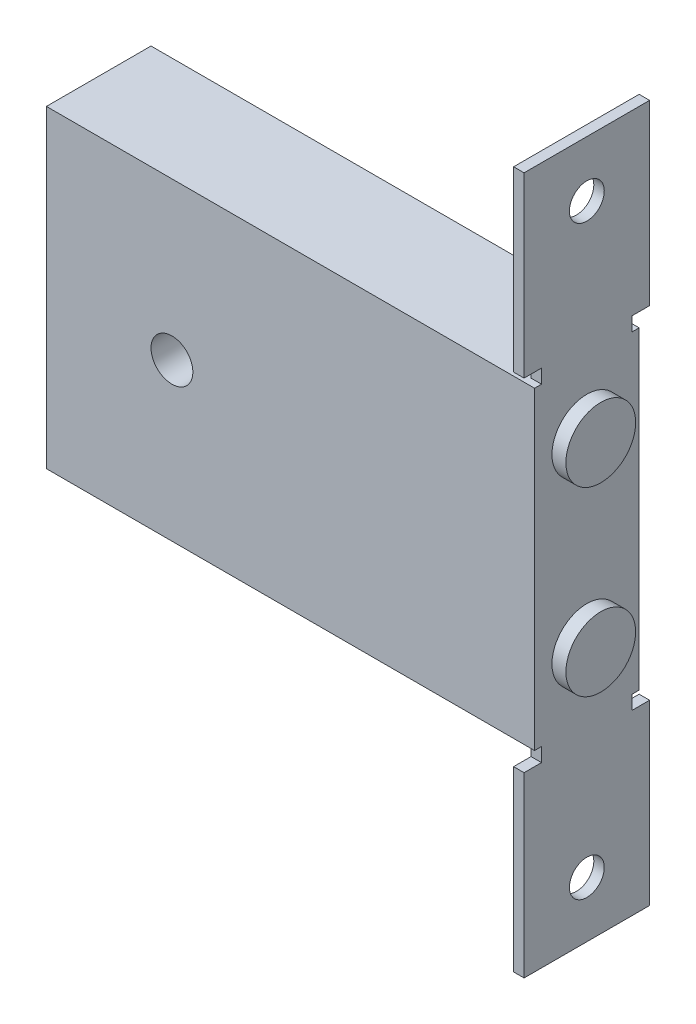
ISO-10303-21;
HEADER;
FILE_DESCRIPTION(('STEP AP214'),'2;1');
FILE_NAME('part.step','',(''),(''),'','','');
FILE_SCHEMA(('AUTOMOTIVE_DESIGN { 1 0 10303 214 1 1 1 1 }'));
ENDSEC;
DATA;
#1=APPLICATION_CONTEXT('core data for automotive mechanical design processes');
#2=APPLICATION_PROTOCOL_DEFINITION('international standard','automotive_design',2000,#1);
#3=PRODUCT_CONTEXT('',#1,'mechanical');
#4=PRODUCT('Part','Part','',(#3));
#5=PRODUCT_RELATED_PRODUCT_CATEGORY('part','',(#4));
#6=PRODUCT_DEFINITION_FORMATION('','',#4);
#7=PRODUCT_DEFINITION_CONTEXT('part definition',#1,'design');
#8=PRODUCT_DEFINITION('design','',#6,#7);
#9=PRODUCT_DEFINITION_SHAPE('','',#8);
#10=(LENGTH_UNIT() NAMED_UNIT(*) SI_UNIT(.MILLI.,.METRE.));
#11=(NAMED_UNIT(*) PLANE_ANGLE_UNIT() SI_UNIT($,.RADIAN.));
#12=(NAMED_UNIT(*) SI_UNIT($,.STERADIAN.) SOLID_ANGLE_UNIT());
#13=UNCERTAINTY_MEASURE_WITH_UNIT(LENGTH_MEASURE(1.E-05),#10,'distance_accuracy_value','');
#14=(GEOMETRIC_REPRESENTATION_CONTEXT(3) GLOBAL_UNCERTAINTY_ASSIGNED_CONTEXT((#13)) GLOBAL_UNIT_ASSIGNED_CONTEXT((#10,
#11,#12)) REPRESENTATION_CONTEXT('',''));
#15=CARTESIAN_POINT('',(0.,0.,0.));
#16=DIRECTION('',(0.,0.,1.));
#17=DIRECTION('',(1.,0.,0.));
#18=AXIS2_PLACEMENT_3D('',#15,#16,#17);
#19=CARTESIAN_POINT('',(0.,0.,15.));
#20=DIRECTION('',(0.,0.,-1.));
#21=DIRECTION('',(-1.,0.,0.));
#22=AXIS2_PLACEMENT_3D('',#19,#20,#21);
#23=PLANE('',#22);
#24=DIRECTION('',(0.,-1.,0.));
#25=VECTOR('',#24,1.);
#26=CARTESIAN_POINT('',(0.,0.,15.));
#27=LINE('',#26,#25);
#28=CARTESIAN_POINT('',(0.,45.,15.));
#29=VERTEX_POINT('',#28);
#30=CARTESIAN_POINT('',(0.,0.,15.));
#31=VERTEX_POINT('',#30);
#32=EDGE_CURVE('E308',#29,#31,#27,.T.);
#33=ORIENTED_EDGE('',*,*,#32,.T.);
#34=DIRECTION('',(1.,0.,0.));
#35=VECTOR('',#34,1.);
#36=CARTESIAN_POINT('',(0.,0.,15.));
#37=LINE('',#36,#35);
#38=CARTESIAN_POINT('',(70.,0.,15.));
#39=VERTEX_POINT('',#38);
#40=EDGE_CURVE('E311',#31,#39,#37,.T.);
#41=ORIENTED_EDGE('',*,*,#40,.T.);
#42=DIRECTION('',(0.,1.,0.));
#43=VECTOR('',#42,1.);
#44=CARTESIAN_POINT('',(70.,0.,15.));
#45=LINE('',#44,#43);
#46=CARTESIAN_POINT('',(70.,45.,15.));
#47=VERTEX_POINT('',#46);
#48=EDGE_CURVE('E314',#39,#47,#45,.T.);
#49=ORIENTED_EDGE('',*,*,#48,.T.);
#50=DIRECTION('',(-1.,0.,0.));
#51=VECTOR('',#50,1.);
#52=CARTESIAN_POINT('',(0.,45.,15.));
#53=LINE('',#52,#51);
#54=EDGE_CURVE('E316',#47,#29,#53,.T.);
#55=ORIENTED_EDGE('',*,*,#54,.T.);
#56=EDGE_LOOP('',(#33,#41,#49,#55));
#57=FACE_BOUND('',#56,.T.);
#58=CARTESIAN_POINT('',(18.,22.5,15.));
#59=DIRECTION('',(0.,0.,1.));
#60=DIRECTION('',(1.,0.,0.));
#61=AXIS2_PLACEMENT_3D('',#58,#59,#60);
#62=CIRCLE('',#61,3.);
#63=CARTESIAN_POINT('',(21.,22.5,15.));
#64=VERTEX_POINT('',#63);
#65=EDGE_CURVE('E302',#64,#64,#62,.T.);
#66=ORIENTED_EDGE('',*,*,#65,.F.);
#67=EDGE_LOOP('',(#66));
#68=FACE_BOUND('',#67,.T.);
#69=ADVANCED_FACE('F34',(#57,#68),#23,.F.);
#70=CARTESIAN_POINT('',(0.,0.,0.));
#71=DIRECTION('',(0.,0.,-1.));
#72=DIRECTION('',(-1.,0.,0.));
#73=AXIS2_PLACEMENT_3D('',#70,#71,#72);
#74=PLANE('',#73);
#75=DIRECTION('',(0.,-1.,0.));
#76=VECTOR('',#75,1.);
#77=CARTESIAN_POINT('',(0.,0.,0.));
#78=LINE('',#77,#76);
#79=CARTESIAN_POINT('',(0.,45.,0.));
#80=VERTEX_POINT('',#79);
#81=CARTESIAN_POINT('',(0.,0.,0.));
#82=VERTEX_POINT('',#81);
#83=EDGE_CURVE('E305',#80,#82,#78,.T.);
#84=ORIENTED_EDGE('',*,*,#83,.F.);
#85=DIRECTION('',(-1.,0.,0.));
#86=VECTOR('',#85,1.);
#87=CARTESIAN_POINT('',(0.,45.,0.));
#88=LINE('',#87,#86);
#89=CARTESIAN_POINT('',(70.,45.,0.));
#90=VERTEX_POINT('',#89);
#91=EDGE_CURVE('E312',#90,#80,#88,.T.);
#92=ORIENTED_EDGE('',*,*,#91,.F.);
#93=DIRECTION('',(0.,1.,0.));
#94=VECTOR('',#93,1.);
#95=CARTESIAN_POINT('',(70.,0.,0.));
#96=LINE('',#95,#94);
#97=CARTESIAN_POINT('',(70.,0.,0.));
#98=VERTEX_POINT('',#97);
#99=EDGE_CURVE('E324',#98,#90,#96,.T.);
#100=ORIENTED_EDGE('',*,*,#99,.F.);
#101=DIRECTION('',(1.,0.,0.));
#102=VECTOR('',#101,1.);
#103=CARTESIAN_POINT('',(0.,0.,0.));
#104=LINE('',#103,#102);
#105=EDGE_CURVE('E321',#82,#98,#104,.T.);
#106=ORIENTED_EDGE('',*,*,#105,.F.);
#107=EDGE_LOOP('',(#84,#92,#100,#106));
#108=FACE_BOUND('',#107,.T.);
#109=CARTESIAN_POINT('',(18.,22.5,0.));
#110=DIRECTION('',(0.,0.,1.));
#111=DIRECTION('',(1.,0.,0.));
#112=AXIS2_PLACEMENT_3D('',#109,#110,#111);
#113=CIRCLE('',#112,3.);
#114=CARTESIAN_POINT('',(21.,22.5,0.));
#115=VERTEX_POINT('',#114);
#116=EDGE_CURVE('E291',#115,#115,#113,.T.);
#117=ORIENTED_EDGE('',*,*,#116,.T.);
#118=EDGE_LOOP('',(#117));
#119=FACE_BOUND('',#118,.T.);
#120=ADVANCED_FACE('F392',(#108,#119),#74,.T.);
#121=CARTESIAN_POINT('',(0.,0.,15.));
#122=DIRECTION('',(1.,0.,0.));
#123=DIRECTION('',(0.,0.,-1.));
#124=AXIS2_PLACEMENT_3D('',#121,#122,#123);
#125=PLANE('',#124);
#126=ORIENTED_EDGE('',*,*,#83,.T.);
#127=DIRECTION('',(0.,0.,-1.));
#128=VECTOR('',#127,1.);
#129=CARTESIAN_POINT('',(0.,0.,15.));
#130=LINE('',#129,#128);
#131=EDGE_CURVE('E337',#31,#82,#130,.T.);
#132=ORIENTED_EDGE('',*,*,#131,.F.);
#133=ORIENTED_EDGE('',*,*,#32,.F.);
#134=DIRECTION('',(0.,0.,-1.));
#135=VECTOR('',#134,1.);
#136=CARTESIAN_POINT('',(0.,45.,15.));
#137=LINE('',#136,#135);
#138=EDGE_CURVE('E318',#29,#80,#137,.T.);
#139=ORIENTED_EDGE('',*,*,#138,.T.);
#140=EDGE_LOOP('',(#126,#132,#133,#139));
#141=FACE_BOUND('',#140,.T.);
#142=ADVANCED_FACE('F36',(#141),#125,.F.);
#143=CARTESIAN_POINT('',(0.,0.,15.));
#144=DIRECTION('',(0.,1.,0.));
#145=DIRECTION('',(0.,0.,1.));
#146=AXIS2_PLACEMENT_3D('',#143,#144,#145);
#147=PLANE('',#146);
#148=DIRECTION('',(0.,0.,-1.));
#149=VECTOR('',#148,1.);
#150=CARTESIAN_POINT('',(70.,0.,15.));
#151=LINE('',#150,#149);
#152=CARTESIAN_POINT('',(70.,0.,1.));
#153=VERTEX_POINT('',#152);
#154=EDGE_CURVE('E333',#153,#98,#151,.T.);
#155=ORIENTED_EDGE('',*,*,#154,.F.);
#156=DIRECTION('',(-1.,0.,0.));
#157=VECTOR('',#156,1.);
#158=CARTESIAN_POINT('',(0.,0.,1.));
#159=LINE('',#158,#157);
#160=CARTESIAN_POINT('',(68.5,0.,1.));
#161=VERTEX_POINT('',#160);
#162=EDGE_CURVE('E239',#153,#161,#159,.T.);
#163=ORIENTED_EDGE('',*,*,#162,.T.);
#164=DIRECTION('',(0.,0.,-1.));
#165=VECTOR('',#164,1.);
#166=CARTESIAN_POINT('',(68.5,0.,15.));
#167=LINE('',#166,#165);
#168=CARTESIAN_POINT('',(68.5,0.,14.));
#169=VERTEX_POINT('',#168);
#170=EDGE_CURVE('E345',#169,#161,#167,.T.);
#171=ORIENTED_EDGE('',*,*,#170,.F.);
#172=DIRECTION('',(1.,0.,0.));
#173=VECTOR('',#172,1.);
#174=CARTESIAN_POINT('',(0.,0.,14.));
#175=LINE('',#174,#173);
#176=CARTESIAN_POINT('',(70.,0.,14.));
#177=VERTEX_POINT('',#176);
#178=EDGE_CURVE('E179',#169,#177,#175,.T.);
#179=ORIENTED_EDGE('',*,*,#178,.T.);
#180=EDGE_CURVE('E334',#39,#177,#151,.T.);
#181=ORIENTED_EDGE('',*,*,#180,.F.);
#182=ORIENTED_EDGE('',*,*,#40,.F.);
#183=ORIENTED_EDGE('',*,*,#131,.T.);
#184=ORIENTED_EDGE('',*,*,#105,.T.);
#185=EDGE_LOOP('',(#155,#163,#171,#179,#181,#182,#183,#184));
#186=FACE_BOUND('',#185,.T.);
#187=ADVANCED_FACE('F354',(#186),#147,.F.);
#188=CARTESIAN_POINT('',(70.,0.,15.));
#189=DIRECTION('',(-1.,0.,0.));
#190=DIRECTION('',(0.,0.,1.));
#191=AXIS2_PLACEMENT_3D('',#188,#189,#190);
#192=PLANE('',#191);
#193=CARTESIAN_POINT('',(70.,9.5,7.5));
#194=DIRECTION('',(-1.,0.,0.));
#195=DIRECTION('',(0.,0.,1.));
#196=AXIS2_PLACEMENT_3D('',#193,#194,#195);
#197=CIRCLE('',#196,5.);
#198=CARTESIAN_POINT('',(70.,9.5,12.5));
#199=VERTEX_POINT('',#198);
#200=EDGE_CURVE('E11',#199,#199,#197,.F.);
#201=ORIENTED_EDGE('',*,*,#200,.F.);
#202=EDGE_LOOP('',(#201));
#203=FACE_BOUND('',#202,.T.);
#204=CARTESIAN_POINT('',(70.,35.5,7.5));
#205=DIRECTION('',(-1.,0.,0.));
#206=DIRECTION('',(0.,0.,1.));
#207=AXIS2_PLACEMENT_3D('',#204,#205,#206);
#208=CIRCLE('',#207,5.);
#209=CARTESIAN_POINT('',(70.,35.5,12.5));
#210=VERTEX_POINT('',#209);
#211=EDGE_CURVE('E42',#210,#210,#208,.F.);
#212=ORIENTED_EDGE('',*,*,#211,.F.);
#213=EDGE_LOOP('',(#212));
#214=FACE_BOUND('',#213,.T.);
#215=ORIENTED_EDGE('',*,*,#180,.T.);
#216=DIRECTION('',(0.,-1.,0.));
#217=VECTOR('',#216,1.);
#218=CARTESIAN_POINT('',(70.,2.04661702711344,14.));
#219=LINE('',#218,#217);
#220=CARTESIAN_POINT('',(70.,-2.00000000000002,14.));
#221=VERTEX_POINT('',#220);
#222=EDGE_CURVE('E213',#177,#221,#219,.T.);
#223=ORIENTED_EDGE('',*,*,#222,.T.);
#224=DIRECTION('',(0.,0.,1.));
#225=VECTOR('',#224,1.);
#226=CARTESIAN_POINT('',(70.,-2.00000000000002,14.));
#227=LINE('',#226,#225);
#228=CARTESIAN_POINT('',(70.,-2.00000000000002,16.5));
#229=VERTEX_POINT('',#228);
#230=EDGE_CURVE('E189',#221,#229,#227,.T.);
#231=ORIENTED_EDGE('',*,*,#230,.T.);
#232=DIRECTION('',(0.,-1.,0.));
#233=VECTOR('',#232,1.);
#234=CARTESIAN_POINT('',(70.,-2.00000000000002,16.5));
#235=LINE('',#234,#233);
#236=CARTESIAN_POINT('',(70.,-27.5,16.5));
#237=VERTEX_POINT('',#236);
#238=EDGE_CURVE('E217',#229,#237,#235,.T.);
#239=ORIENTED_EDGE('',*,*,#238,.T.);
#240=DIRECTION('',(0.,0.,-1.));
#241=VECTOR('',#240,1.);
#242=CARTESIAN_POINT('',(70.,-27.5,-1.5));
#243=LINE('',#242,#241);
#244=CARTESIAN_POINT('',(70.,-27.5,-1.5));
#245=VERTEX_POINT('',#244);
#246=EDGE_CURVE('E220',#237,#245,#243,.T.);
#247=ORIENTED_EDGE('',*,*,#246,.T.);
#248=DIRECTION('',(0.,1.,0.));
#249=VECTOR('',#248,1.);
#250=CARTESIAN_POINT('',(70.,-2.00000000000002,-1.5));
#251=LINE('',#250,#249);
#252=CARTESIAN_POINT('',(70.,-2.00000000000002,-1.5));
#253=VERTEX_POINT('',#252);
#254=EDGE_CURVE('E223',#245,#253,#251,.T.);
#255=ORIENTED_EDGE('',*,*,#254,.T.);
#256=DIRECTION('',(0.,0.,1.));
#257=VECTOR('',#256,1.);
#258=CARTESIAN_POINT('',(70.,-2.00000000000002,1.));
#259=LINE('',#258,#257);
#260=CARTESIAN_POINT('',(70.,-2.00000000000002,1.));
#261=VERTEX_POINT('',#260);
#262=EDGE_CURVE('E226',#253,#261,#259,.T.);
#263=ORIENTED_EDGE('',*,*,#262,.T.);
#264=DIRECTION('',(0.,1.,0.));
#265=VECTOR('',#264,1.);
#266=CARTESIAN_POINT('',(70.,2.04661702711344,1.));
#267=LINE('',#266,#265);
#268=EDGE_CURVE('E49',#261,#153,#267,.T.);
#269=ORIENTED_EDGE('',*,*,#268,.T.);
#270=ORIENTED_EDGE('',*,*,#154,.T.);
#271=ORIENTED_EDGE('',*,*,#99,.T.);
#272=DIRECTION('',(0.,0.,-1.));
#273=VECTOR('',#272,1.);
#274=CARTESIAN_POINT('',(70.,45.,15.));
#275=LINE('',#274,#273);
#276=CARTESIAN_POINT('',(70.,45.,1.));
#277=VERTEX_POINT('',#276);
#278=EDGE_CURVE('E330',#277,#90,#275,.T.);
#279=ORIENTED_EDGE('',*,*,#278,.F.);
#280=DIRECTION('',(0.,1.,0.));
#281=VECTOR('',#280,1.);
#282=CARTESIAN_POINT('',(70.,42.9533829728865,1.));
#283=LINE('',#282,#281);
#284=CARTESIAN_POINT('',(70.,47.,1.));
#285=VERTEX_POINT('',#284);
#286=EDGE_CURVE('E246',#277,#285,#283,.T.);
#287=ORIENTED_EDGE('',*,*,#286,.T.);
#288=DIRECTION('',(0.,0.,-1.));
#289=VECTOR('',#288,1.);
#290=CARTESIAN_POINT('',(70.,47.,1.));
#291=LINE('',#290,#289);
#292=CARTESIAN_POINT('',(70.,47.,-1.5));
#293=VERTEX_POINT('',#292);
#294=EDGE_CURVE('E272',#285,#293,#291,.T.);
#295=ORIENTED_EDGE('',*,*,#294,.T.);
#296=DIRECTION('',(0.,1.,0.));
#297=VECTOR('',#296,1.);
#298=CARTESIAN_POINT('',(70.,47.,-1.5));
#299=LINE('',#298,#297);
#300=CARTESIAN_POINT('',(70.,72.5,-1.5));
#301=VERTEX_POINT('',#300);
#302=EDGE_CURVE('E275',#293,#301,#299,.T.);
#303=ORIENTED_EDGE('',*,*,#302,.T.);
#304=DIRECTION('',(0.,0.,1.));
#305=VECTOR('',#304,1.);
#306=CARTESIAN_POINT('',(70.,72.5,-1.5));
#307=LINE('',#306,#305);
#308=CARTESIAN_POINT('',(70.,72.5,16.5));
#309=VERTEX_POINT('',#308);
#310=EDGE_CURVE('E278',#301,#309,#307,.T.);
#311=ORIENTED_EDGE('',*,*,#310,.T.);
#312=DIRECTION('',(0.,-1.,0.));
#313=VECTOR('',#312,1.);
#314=CARTESIAN_POINT('',(70.,47.,16.5));
#315=LINE('',#314,#313);
#316=CARTESIAN_POINT('',(70.,47.,16.5));
#317=VERTEX_POINT('',#316);
#318=EDGE_CURVE('E281',#309,#317,#315,.T.);
#319=ORIENTED_EDGE('',*,*,#318,.T.);
#320=DIRECTION('',(0.,0.,-1.));
#321=VECTOR('',#320,1.);
#322=CARTESIAN_POINT('',(70.,47.,14.));
#323=LINE('',#322,#321);
#324=CARTESIAN_POINT('',(70.,47.,14.));
#325=VERTEX_POINT('',#324);
#326=EDGE_CURVE('E284',#317,#325,#323,.T.);
#327=ORIENTED_EDGE('',*,*,#326,.T.);
#328=DIRECTION('',(0.,-1.,0.));
#329=VECTOR('',#328,1.);
#330=CARTESIAN_POINT('',(70.,42.9533829728865,14.));
#331=LINE('',#330,#329);
#332=CARTESIAN_POINT('',(70.,45.,14.));
#333=VERTEX_POINT('',#332);
#334=EDGE_CURVE('E252',#325,#333,#331,.T.);
#335=ORIENTED_EDGE('',*,*,#334,.T.);
#336=EDGE_CURVE('E331',#47,#333,#275,.T.);
#337=ORIENTED_EDGE('',*,*,#336,.F.);
#338=ORIENTED_EDGE('',*,*,#48,.F.);
#339=EDGE_LOOP('',(#215,#223,#231,#239,#247,#255,#263,#269,#270,#271,#279,#287,#295,#303,#311,
#319,#327,#335,#337,#338));
#340=FACE_BOUND('',#339,.T.);
#341=CARTESIAN_POINT('',(70.,64.5,7.5));
#342=DIRECTION('',(1.,0.,0.));
#343=DIRECTION('',(0.,0.,-1.));
#344=AXIS2_PLACEMENT_3D('',#341,#342,#343);
#345=CIRCLE('',#344,2.5);
#346=CARTESIAN_POINT('',(70.,64.5,5.));
#347=VERTEX_POINT('',#346);
#348=EDGE_CURVE('E242',#347,#347,#345,.T.);
#349=ORIENTED_EDGE('',*,*,#348,.F.);
#350=EDGE_LOOP('',(#349));
#351=FACE_BOUND('',#350,.T.);
#352=CARTESIAN_POINT('',(70.,-19.5,7.5));
#353=DIRECTION('',(1.,0.,0.));
#354=DIRECTION('',(0.,0.,1.));
#355=AXIS2_PLACEMENT_3D('',#352,#353,#354);
#356=CIRCLE('',#355,2.5);
#357=CARTESIAN_POINT('',(70.,-19.5,10.));
#358=VERTEX_POINT('',#357);
#359=EDGE_CURVE('E364',#358,#358,#356,.T.);
#360=ORIENTED_EDGE('',*,*,#359,.F.);
#361=EDGE_LOOP('',(#360));
#362=FACE_BOUND('',#361,.T.);
#363=ADVANCED_FACE('F351',(#203,#214,#340,#351,#362),#192,.F.);
#364=CARTESIAN_POINT('',(0.,45.,15.));
#365=DIRECTION('',(0.,-1.,0.));
#366=DIRECTION('',(0.,0.,-1.));
#367=AXIS2_PLACEMENT_3D('',#364,#365,#366);
#368=PLANE('',#367);
#369=ORIENTED_EDGE('',*,*,#336,.T.);
#370=DIRECTION('',(-1.,0.,0.));
#371=VECTOR('',#370,1.);
#372=CARTESIAN_POINT('',(0.,45.,14.));
#373=LINE('',#372,#371);
#374=CARTESIAN_POINT('',(68.5,45.,14.));
#375=VERTEX_POINT('',#374);
#376=EDGE_CURVE('E343',#333,#375,#373,.T.);
#377=ORIENTED_EDGE('',*,*,#376,.T.);
#378=DIRECTION('',(0.,0.,-1.));
#379=VECTOR('',#378,1.);
#380=CARTESIAN_POINT('',(68.5,45.,15.));
#381=LINE('',#380,#379);
#382=CARTESIAN_POINT('',(68.5,45.,1.));
#383=VERTEX_POINT('',#382);
#384=EDGE_CURVE('E57',#375,#383,#381,.T.);
#385=ORIENTED_EDGE('',*,*,#384,.T.);
#386=DIRECTION('',(1.,0.,0.));
#387=VECTOR('',#386,1.);
#388=CARTESIAN_POINT('',(0.,45.,1.));
#389=LINE('',#388,#387);
#390=EDGE_CURVE('E341',#383,#277,#389,.T.);
#391=ORIENTED_EDGE('',*,*,#390,.T.);
#392=ORIENTED_EDGE('',*,*,#278,.T.);
#393=ORIENTED_EDGE('',*,*,#91,.T.);
#394=ORIENTED_EDGE('',*,*,#138,.F.);
#395=ORIENTED_EDGE('',*,*,#54,.F.);
#396=EDGE_LOOP('',(#369,#377,#385,#391,#392,#393,#394,#395));
#397=FACE_BOUND('',#396,.T.);
#398=ADVANCED_FACE('F353',(#397),#368,.F.);
#399=CARTESIAN_POINT('',(18.,22.5,15.));
#400=DIRECTION('',(0.,0.,-1.));
#401=DIRECTION('',(-1.,0.,0.));
#402=AXIS2_PLACEMENT_3D('',#399,#400,#401);
#403=CYLINDRICAL_SURFACE('',#402,3.);
#404=ORIENTED_EDGE('',*,*,#65,.T.);
#405=EDGE_LOOP('',(#404));
#406=FACE_BOUND('',#405,.T.);
#407=ORIENTED_EDGE('',*,*,#116,.F.);
#408=EDGE_LOOP('',(#407));
#409=FACE_BOUND('',#408,.T.);
#410=ADVANCED_FACE('F402',(#406,#409),#403,.F.);
#411=CARTESIAN_POINT('',(68.5,42.9533829728865,14.));
#412=DIRECTION('',(0.,0.,1.));
#413=DIRECTION('',(1.,0.,0.));
#414=AXIS2_PLACEMENT_3D('',#411,#412,#413);
#415=PLANE('',#414);
#416=ORIENTED_EDGE('',*,*,#376,.F.);
#417=ORIENTED_EDGE('',*,*,#334,.F.);
#418=DIRECTION('',(1.,0.,0.));
#419=VECTOR('',#418,1.);
#420=CARTESIAN_POINT('',(68.5,47.,14.));
#421=LINE('',#420,#419);
#422=CARTESIAN_POINT('',(68.5,47.,14.));
#423=VERTEX_POINT('',#422);
#424=EDGE_CURVE('E289',#423,#325,#421,.T.);
#425=ORIENTED_EDGE('',*,*,#424,.F.);
#426=DIRECTION('',(0.,-1.,0.));
#427=VECTOR('',#426,1.);
#428=CARTESIAN_POINT('',(68.5,42.9533829728865,14.));
#429=LINE('',#428,#427);
#430=EDGE_CURVE('E267',#423,#375,#429,.T.);
#431=ORIENTED_EDGE('',*,*,#430,.T.);
#432=EDGE_LOOP('',(#416,#417,#425,#431));
#433=FACE_BOUND('',#432,.T.);
#434=ADVANCED_FACE('F425',(#433),#415,.T.);
#435=CARTESIAN_POINT('',(68.5,42.9533829728865,1.));
#436=DIRECTION('',(0.,0.,-1.));
#437=DIRECTION('',(-1.,0.,0.));
#438=AXIS2_PLACEMENT_3D('',#435,#436,#437);
#439=PLANE('',#438);
#440=ORIENTED_EDGE('',*,*,#390,.F.);
#441=DIRECTION('',(0.,1.,0.));
#442=VECTOR('',#441,1.);
#443=CARTESIAN_POINT('',(68.5,42.9533829728865,1.));
#444=LINE('',#443,#442);
#445=CARTESIAN_POINT('',(68.5,47.,1.));
#446=VERTEX_POINT('',#445);
#447=EDGE_CURVE('E249',#383,#446,#444,.T.);
#448=ORIENTED_EDGE('',*,*,#447,.T.);
#449=DIRECTION('',(1.,0.,0.));
#450=VECTOR('',#449,1.);
#451=CARTESIAN_POINT('',(68.5,47.,1.));
#452=LINE('',#451,#450);
#453=EDGE_CURVE('E270',#446,#285,#452,.T.);
#454=ORIENTED_EDGE('',*,*,#453,.T.);
#455=ORIENTED_EDGE('',*,*,#286,.F.);
#456=EDGE_LOOP('',(#440,#448,#454,#455));
#457=FACE_BOUND('',#456,.T.);
#458=ADVANCED_FACE('F440',(#457),#439,.T.);
#459=CARTESIAN_POINT('',(68.5,0.,0.));
#460=DIRECTION('',(-1.,0.,0.));
#461=DIRECTION('',(0.,0.,1.));
#462=AXIS2_PLACEMENT_3D('',#459,#460,#461);
#463=PLANE('',#462);
#464=CARTESIAN_POINT('',(68.5,64.5,7.5));
#465=DIRECTION('',(1.,0.,0.));
#466=DIRECTION('',(0.,0.,-1.));
#467=AXIS2_PLACEMENT_3D('',#464,#465,#466);
#468=CIRCLE('',#467,2.5);
#469=CARTESIAN_POINT('',(68.5,64.5,5.));
#470=VERTEX_POINT('',#469);
#471=EDGE_CURVE('E243',#470,#470,#468,.T.);
#472=ORIENTED_EDGE('',*,*,#471,.T.);
#473=EDGE_LOOP('',(#472));
#474=FACE_BOUND('',#473,.T.);
#475=ORIENTED_EDGE('',*,*,#384,.F.);
#476=ORIENTED_EDGE('',*,*,#430,.F.);
#477=DIRECTION('',(0.,0.,-1.));
#478=VECTOR('',#477,1.);
#479=CARTESIAN_POINT('',(68.5,47.,14.));
#480=LINE('',#479,#478);
#481=CARTESIAN_POINT('',(68.5,47.,16.5));
#482=VERTEX_POINT('',#481);
#483=EDGE_CURVE('E264',#482,#423,#480,.T.);
#484=ORIENTED_EDGE('',*,*,#483,.F.);
#485=DIRECTION('',(0.,-1.,0.));
#486=VECTOR('',#485,1.);
#487=CARTESIAN_POINT('',(68.5,47.,16.5));
#488=LINE('',#487,#486);
#489=CARTESIAN_POINT('',(68.5,72.5,16.5));
#490=VERTEX_POINT('',#489);
#491=EDGE_CURVE('E261',#490,#482,#488,.T.);
#492=ORIENTED_EDGE('',*,*,#491,.F.);
#493=DIRECTION('',(0.,0.,1.));
#494=VECTOR('',#493,1.);
#495=CARTESIAN_POINT('',(68.5,72.5,-1.5));
#496=LINE('',#495,#494);
#497=CARTESIAN_POINT('',(68.5,72.5,-1.5));
#498=VERTEX_POINT('',#497);
#499=EDGE_CURVE('E258',#498,#490,#496,.T.);
#500=ORIENTED_EDGE('',*,*,#499,.F.);
#501=DIRECTION('',(0.,1.,0.));
#502=VECTOR('',#501,1.);
#503=CARTESIAN_POINT('',(68.5,47.,-1.5));
#504=LINE('',#503,#502);
#505=CARTESIAN_POINT('',(68.5,47.,-1.5));
#506=VERTEX_POINT('',#505);
#507=EDGE_CURVE('E255',#506,#498,#504,.T.);
#508=ORIENTED_EDGE('',*,*,#507,.F.);
#509=DIRECTION('',(0.,0.,-1.));
#510=VECTOR('',#509,1.);
#511=CARTESIAN_POINT('',(68.5,47.,1.));
#512=LINE('',#511,#510);
#513=EDGE_CURVE('E251',#446,#506,#512,.T.);
#514=ORIENTED_EDGE('',*,*,#513,.F.);
#515=ORIENTED_EDGE('',*,*,#447,.F.);
#516=EDGE_LOOP('',(#475,#476,#484,#492,#500,#508,#514,#515));
#517=FACE_BOUND('',#516,.T.);
#518=ADVANCED_FACE('F434',(#474,#517),#463,.T.);
#519=CARTESIAN_POINT('',(68.5,47.,14.));
#520=DIRECTION('',(0.,-1.,0.));
#521=DIRECTION('',(0.,0.,-1.));
#522=AXIS2_PLACEMENT_3D('',#519,#520,#521);
#523=PLANE('',#522);
#524=ORIENTED_EDGE('',*,*,#326,.F.);
#525=DIRECTION('',(1.,0.,0.));
#526=VECTOR('',#525,1.);
#527=CARTESIAN_POINT('',(68.5,47.,16.5));
#528=LINE('',#527,#526);
#529=EDGE_CURVE('E292',#482,#317,#528,.T.);
#530=ORIENTED_EDGE('',*,*,#529,.F.);
#531=ORIENTED_EDGE('',*,*,#483,.T.);
#532=ORIENTED_EDGE('',*,*,#424,.T.);
#533=EDGE_LOOP('',(#524,#530,#531,#532));
#534=FACE_BOUND('',#533,.T.);
#535=ADVANCED_FACE('F430',(#534),#523,.T.);
#536=CARTESIAN_POINT('',(68.5,47.,16.5));
#537=DIRECTION('',(0.,0.,1.));
#538=DIRECTION('',(1.,0.,0.));
#539=AXIS2_PLACEMENT_3D('',#536,#537,#538);
#540=PLANE('',#539);
#541=ORIENTED_EDGE('',*,*,#318,.F.);
#542=DIRECTION('',(1.,0.,0.));
#543=VECTOR('',#542,1.);
#544=CARTESIAN_POINT('',(68.5,72.5,16.5));
#545=LINE('',#544,#543);
#546=EDGE_CURVE('E294',#490,#309,#545,.T.);
#547=ORIENTED_EDGE('',*,*,#546,.F.);
#548=ORIENTED_EDGE('',*,*,#491,.T.);
#549=ORIENTED_EDGE('',*,*,#529,.T.);
#550=EDGE_LOOP('',(#541,#547,#548,#549));
#551=FACE_BOUND('',#550,.T.);
#552=ADVANCED_FACE('F453',(#551),#540,.T.);
#553=CARTESIAN_POINT('',(68.5,72.5,-1.5));
#554=DIRECTION('',(0.,1.,0.));
#555=DIRECTION('',(0.,0.,1.));
#556=AXIS2_PLACEMENT_3D('',#553,#554,#555);
#557=PLANE('',#556);
#558=ORIENTED_EDGE('',*,*,#310,.F.);
#559=DIRECTION('',(1.,0.,0.));
#560=VECTOR('',#559,1.);
#561=CARTESIAN_POINT('',(68.5,72.5,-1.5));
#562=LINE('',#561,#560);
#563=EDGE_CURVE('E296',#498,#301,#562,.T.);
#564=ORIENTED_EDGE('',*,*,#563,.F.);
#565=ORIENTED_EDGE('',*,*,#499,.T.);
#566=ORIENTED_EDGE('',*,*,#546,.T.);
#567=EDGE_LOOP('',(#558,#564,#565,#566));
#568=FACE_BOUND('',#567,.T.);
#569=ADVANCED_FACE('F451',(#568),#557,.T.);
#570=CARTESIAN_POINT('',(68.5,47.,-1.5));
#571=DIRECTION('',(0.,0.,-1.));
#572=DIRECTION('',(-1.,0.,0.));
#573=AXIS2_PLACEMENT_3D('',#570,#571,#572);
#574=PLANE('',#573);
#575=ORIENTED_EDGE('',*,*,#302,.F.);
#576=DIRECTION('',(1.,0.,0.));
#577=VECTOR('',#576,1.);
#578=CARTESIAN_POINT('',(68.5,47.,-1.5));
#579=LINE('',#578,#577);
#580=EDGE_CURVE('E298',#506,#293,#579,.T.);
#581=ORIENTED_EDGE('',*,*,#580,.F.);
#582=ORIENTED_EDGE('',*,*,#507,.T.);
#583=ORIENTED_EDGE('',*,*,#563,.T.);
#584=EDGE_LOOP('',(#575,#581,#582,#583));
#585=FACE_BOUND('',#584,.T.);
#586=ADVANCED_FACE('F448',(#585),#574,.T.);
#587=CARTESIAN_POINT('',(68.5,47.,1.));
#588=DIRECTION('',(0.,-1.,0.));
#589=DIRECTION('',(0.,0.,-1.));
#590=AXIS2_PLACEMENT_3D('',#587,#588,#589);
#591=PLANE('',#590);
#592=ORIENTED_EDGE('',*,*,#294,.F.);
#593=ORIENTED_EDGE('',*,*,#453,.F.);
#594=ORIENTED_EDGE('',*,*,#513,.T.);
#595=ORIENTED_EDGE('',*,*,#580,.T.);
#596=EDGE_LOOP('',(#592,#593,#594,#595));
#597=FACE_BOUND('',#596,.T.);
#598=ADVANCED_FACE('F444',(#597),#591,.T.);
#599=CARTESIAN_POINT('',(68.5,64.5,7.5));
#600=DIRECTION('',(1.,0.,0.));
#601=DIRECTION('',(0.,0.,-1.));
#602=AXIS2_PLACEMENT_3D('',#599,#600,#601);
#603=CYLINDRICAL_SURFACE('',#602,2.5);
#604=ORIENTED_EDGE('',*,*,#471,.F.);
#605=EDGE_LOOP('',(#604));
#606=FACE_BOUND('',#605,.T.);
#607=ORIENTED_EDGE('',*,*,#348,.T.);
#608=EDGE_LOOP('',(#607));
#609=FACE_BOUND('',#608,.T.);
#610=ADVANCED_FACE('F467',(#606,#609),#603,.F.);
#611=CARTESIAN_POINT('',(68.5,0.,0.));
#612=DIRECTION('',(1.,0.,0.));
#613=DIRECTION('',(0.,0.,-1.));
#614=AXIS2_PLACEMENT_3D('',#611,#612,#613);
#615=PLANE('',#614);
#616=CARTESIAN_POINT('',(68.5,-19.5,7.5));
#617=DIRECTION('',(1.,0.,0.));
#618=DIRECTION('',(0.,0.,1.));
#619=AXIS2_PLACEMENT_3D('',#616,#617,#618);
#620=CIRCLE('',#619,2.5);
#621=CARTESIAN_POINT('',(68.5,-19.5,10.));
#622=VERTEX_POINT('',#621);
#623=EDGE_CURVE('E215',#622,#622,#620,.T.);
#624=ORIENTED_EDGE('',*,*,#623,.T.);
#625=EDGE_LOOP('',(#624));
#626=FACE_BOUND('',#625,.T.);
#627=DIRECTION('',(0.,-1.,0.));
#628=VECTOR('',#627,1.);
#629=CARTESIAN_POINT('',(68.5,2.04661702711344,14.));
#630=LINE('',#629,#628);
#631=CARTESIAN_POINT('',(68.5,-2.00000000000002,14.));
#632=VERTEX_POINT('',#631);
#633=EDGE_CURVE('E173',#169,#632,#630,.T.);
#634=ORIENTED_EDGE('',*,*,#633,.F.);
#635=ORIENTED_EDGE('',*,*,#170,.T.);
#636=DIRECTION('',(0.,1.,0.));
#637=VECTOR('',#636,1.);
#638=CARTESIAN_POINT('',(68.5,2.04661702711344,1.));
#639=LINE('',#638,#637);
#640=CARTESIAN_POINT('',(68.5,-2.00000000000002,1.));
#641=VERTEX_POINT('',#640);
#642=EDGE_CURVE('E191',#641,#161,#639,.T.);
#643=ORIENTED_EDGE('',*,*,#642,.F.);
#644=DIRECTION('',(0.,0.,1.));
#645=VECTOR('',#644,1.);
#646=CARTESIAN_POINT('',(68.5,-2.00000000000002,1.));
#647=LINE('',#646,#645);
#648=CARTESIAN_POINT('',(68.5,-2.00000000000002,-1.5));
#649=VERTEX_POINT('',#648);
#650=EDGE_CURVE('E208',#649,#641,#647,.T.);
#651=ORIENTED_EDGE('',*,*,#650,.F.);
#652=DIRECTION('',(0.,1.,0.));
#653=VECTOR('',#652,1.);
#654=CARTESIAN_POINT('',(68.5,-2.00000000000002,-1.5));
#655=LINE('',#654,#653);
#656=CARTESIAN_POINT('',(68.5,-27.5,-1.5));
#657=VERTEX_POINT('',#656);
#658=EDGE_CURVE('E205',#657,#649,#655,.T.);
#659=ORIENTED_EDGE('',*,*,#658,.F.);
#660=DIRECTION('',(0.,0.,-1.));
#661=VECTOR('',#660,1.);
#662=CARTESIAN_POINT('',(68.5,-27.5,-1.5));
#663=LINE('',#662,#661);
#664=CARTESIAN_POINT('',(68.5,-27.5,16.5));
#665=VERTEX_POINT('',#664);
#666=EDGE_CURVE('E199',#665,#657,#663,.T.);
#667=ORIENTED_EDGE('',*,*,#666,.F.);
#668=DIRECTION('',(0.,-1.,0.));
#669=VECTOR('',#668,1.);
#670=CARTESIAN_POINT('',(68.5,-2.00000000000002,16.5));
#671=LINE('',#670,#669);
#672=CARTESIAN_POINT('',(68.5,-2.00000000000002,16.5));
#673=VERTEX_POINT('',#672);
#674=EDGE_CURVE('E197',#673,#665,#671,.T.);
#675=ORIENTED_EDGE('',*,*,#674,.F.);
#676=DIRECTION('',(0.,0.,1.));
#677=VECTOR('',#676,1.);
#678=CARTESIAN_POINT('',(68.5,-2.00000000000002,14.));
#679=LINE('',#678,#677);
#680=EDGE_CURVE('E183',#632,#673,#679,.T.);
#681=ORIENTED_EDGE('',*,*,#680,.F.);
#682=EDGE_LOOP('',(#634,#635,#643,#651,#659,#667,#675,#681));
#683=FACE_BOUND('',#682,.T.);
#684=ADVANCED_FACE('F194',(#626,#683),#615,.F.);
#685=CARTESIAN_POINT('',(68.5,2.04661702711344,1.));
#686=DIRECTION('',(0.,0.,-1.));
#687=DIRECTION('',(-1.,0.,0.));
#688=AXIS2_PLACEMENT_3D('',#685,#686,#687);
#689=PLANE('',#688);
#690=ORIENTED_EDGE('',*,*,#162,.F.);
#691=ORIENTED_EDGE('',*,*,#268,.F.);
#692=DIRECTION('',(1.,0.,0.));
#693=VECTOR('',#692,1.);
#694=CARTESIAN_POINT('',(68.5,-2.00000000000002,1.));
#695=LINE('',#694,#693);
#696=EDGE_CURVE('E229',#641,#261,#695,.T.);
#697=ORIENTED_EDGE('',*,*,#696,.F.);
#698=ORIENTED_EDGE('',*,*,#642,.T.);
#699=EDGE_LOOP('',(#690,#691,#697,#698));
#700=FACE_BOUND('',#699,.T.);
#701=ADVANCED_FACE('F486',(#700),#689,.T.);
#702=CARTESIAN_POINT('',(68.5,2.04661702711344,14.));
#703=DIRECTION('',(0.,0.,1.));
#704=DIRECTION('',(1.,0.,0.));
#705=AXIS2_PLACEMENT_3D('',#702,#703,#704);
#706=PLANE('',#705);
#707=ORIENTED_EDGE('',*,*,#178,.F.);
#708=ORIENTED_EDGE('',*,*,#633,.T.);
#709=DIRECTION('',(1.,0.,0.));
#710=VECTOR('',#709,1.);
#711=CARTESIAN_POINT('',(68.5,-2.00000000000002,14.));
#712=LINE('',#711,#710);
#713=EDGE_CURVE('E176',#632,#221,#712,.T.);
#714=ORIENTED_EDGE('',*,*,#713,.T.);
#715=ORIENTED_EDGE('',*,*,#222,.F.);
#716=EDGE_LOOP('',(#707,#708,#714,#715));
#717=FACE_BOUND('',#716,.T.);
#718=ADVANCED_FACE('F175',(#717),#706,.T.);
#719=CARTESIAN_POINT('',(68.5,-2.00000000000002,1.));
#720=DIRECTION('',(0.,1.,0.));
#721=DIRECTION('',(0.,0.,1.));
#722=AXIS2_PLACEMENT_3D('',#719,#720,#721);
#723=PLANE('',#722);
#724=ORIENTED_EDGE('',*,*,#262,.F.);
#725=DIRECTION('',(1.,0.,0.));
#726=VECTOR('',#725,1.);
#727=CARTESIAN_POINT('',(68.5,-2.00000000000002,-1.5));
#728=LINE('',#727,#726);
#729=EDGE_CURVE('E231',#649,#253,#728,.T.);
#730=ORIENTED_EDGE('',*,*,#729,.F.);
#731=ORIENTED_EDGE('',*,*,#650,.T.);
#732=ORIENTED_EDGE('',*,*,#696,.T.);
#733=EDGE_LOOP('',(#724,#730,#731,#732));
#734=FACE_BOUND('',#733,.T.);
#735=ADVANCED_FACE('F485',(#734),#723,.T.);
#736=CARTESIAN_POINT('',(68.5,-2.00000000000002,-1.5));
#737=DIRECTION('',(0.,0.,-1.));
#738=DIRECTION('',(-1.,0.,0.));
#739=AXIS2_PLACEMENT_3D('',#736,#737,#738);
#740=PLANE('',#739);
#741=ORIENTED_EDGE('',*,*,#254,.F.);
#742=DIRECTION('',(1.,0.,0.));
#743=VECTOR('',#742,1.);
#744=CARTESIAN_POINT('',(68.5,-27.5,-1.5));
#745=LINE('',#744,#743);
#746=EDGE_CURVE('E233',#657,#245,#745,.T.);
#747=ORIENTED_EDGE('',*,*,#746,.F.);
#748=ORIENTED_EDGE('',*,*,#658,.T.);
#749=ORIENTED_EDGE('',*,*,#729,.T.);
#750=EDGE_LOOP('',(#741,#747,#748,#749));
#751=FACE_BOUND('',#750,.T.);
#752=ADVANCED_FACE('F497',(#751),#740,.T.);
#753=CARTESIAN_POINT('',(68.5,-27.5,-1.5));
#754=DIRECTION('',(0.,-1.,0.));
#755=DIRECTION('',(0.,0.,-1.));
#756=AXIS2_PLACEMENT_3D('',#753,#754,#755);
#757=PLANE('',#756);
#758=ORIENTED_EDGE('',*,*,#246,.F.);
#759=DIRECTION('',(1.,0.,0.));
#760=VECTOR('',#759,1.);
#761=CARTESIAN_POINT('',(68.5,-27.5,16.5));
#762=LINE('',#761,#760);
#763=EDGE_CURVE('E235',#665,#237,#762,.T.);
#764=ORIENTED_EDGE('',*,*,#763,.F.);
#765=ORIENTED_EDGE('',*,*,#666,.T.);
#766=ORIENTED_EDGE('',*,*,#746,.T.);
#767=EDGE_LOOP('',(#758,#764,#765,#766));
#768=FACE_BOUND('',#767,.T.);
#769=ADVANCED_FACE('F493',(#768),#757,.T.);
#770=CARTESIAN_POINT('',(68.5,-2.00000000000002,16.5));
#771=DIRECTION('',(0.,0.,1.));
#772=DIRECTION('',(1.,0.,0.));
#773=AXIS2_PLACEMENT_3D('',#770,#771,#772);
#774=PLANE('',#773);
#775=ORIENTED_EDGE('',*,*,#238,.F.);
#776=DIRECTION('',(1.,0.,0.));
#777=VECTOR('',#776,1.);
#778=CARTESIAN_POINT('',(68.5,-2.00000000000002,16.5));
#779=LINE('',#778,#777);
#780=EDGE_CURVE('E190',#673,#229,#779,.T.);
#781=ORIENTED_EDGE('',*,*,#780,.F.);
#782=ORIENTED_EDGE('',*,*,#674,.T.);
#783=ORIENTED_EDGE('',*,*,#763,.T.);
#784=EDGE_LOOP('',(#775,#781,#782,#783));
#785=FACE_BOUND('',#784,.T.);
#786=ADVANCED_FACE('F490',(#785),#774,.T.);
#787=CARTESIAN_POINT('',(68.5,-2.00000000000002,14.));
#788=DIRECTION('',(0.,1.,0.));
#789=DIRECTION('',(0.,0.,1.));
#790=AXIS2_PLACEMENT_3D('',#787,#788,#789);
#791=PLANE('',#790);
#792=ORIENTED_EDGE('',*,*,#230,.F.);
#793=ORIENTED_EDGE('',*,*,#713,.F.);
#794=ORIENTED_EDGE('',*,*,#680,.T.);
#795=ORIENTED_EDGE('',*,*,#780,.T.);
#796=EDGE_LOOP('',(#792,#793,#794,#795));
#797=FACE_BOUND('',#796,.T.);
#798=ADVANCED_FACE('F187',(#797),#791,.T.);
#799=CARTESIAN_POINT('',(68.5,-19.5,7.5));
#800=DIRECTION('',(1.,0.,0.));
#801=DIRECTION('',(0.,0.,-1.));
#802=AXIS2_PLACEMENT_3D('',#799,#800,#801);
#803=CYLINDRICAL_SURFACE('',#802,2.5);
#804=ORIENTED_EDGE('',*,*,#623,.F.);
#805=EDGE_LOOP('',(#804));
#806=FACE_BOUND('',#805,.T.);
#807=ORIENTED_EDGE('',*,*,#359,.T.);
#808=EDGE_LOOP('',(#807));
#809=FACE_BOUND('',#808,.T.);
#810=ADVANCED_FACE('F489',(#806,#809),#803,.F.);
#811=CARTESIAN_POINT('',(72.,35.5,7.5));
#812=DIRECTION('',(-1.,0.,0.));
#813=DIRECTION('',(0.,0.,1.));
#814=AXIS2_PLACEMENT_3D('',#811,#812,#813);
#815=CYLINDRICAL_SURFACE('',#814,5.);
#816=CARTESIAN_POINT('',(72.,35.5,7.5));
#817=DIRECTION('',(1.,0.,0.));
#818=DIRECTION('',(0.,0.,-1.));
#819=AXIS2_PLACEMENT_3D('',#816,#817,#818);
#820=CIRCLE('',#819,5.);
#821=CARTESIAN_POINT('',(72.,35.5,2.5));
#822=VERTEX_POINT('',#821);
#823=EDGE_CURVE('E366',#822,#822,#820,.T.);
#824=ORIENTED_EDGE('',*,*,#823,.F.);
#825=EDGE_LOOP('',(#824));
#826=FACE_BOUND('',#825,.T.);
#827=ORIENTED_EDGE('',*,*,#211,.T.);
#828=EDGE_LOOP('',(#827));
#829=FACE_BOUND('',#828,.T.);
#830=ADVANCED_FACE('F349',(#826,#829),#815,.T.);
#831=CARTESIAN_POINT('',(72.,35.5,7.5));
#832=DIRECTION('',(1.,0.,0.));
#833=DIRECTION('',(0.,0.,-1.));
#834=AXIS2_PLACEMENT_3D('',#831,#832,#833);
#835=PLANE('',#834);
#836=ORIENTED_EDGE('',*,*,#823,.T.);
#837=EDGE_LOOP('',(#836));
#838=FACE_BOUND('',#837,.T.);
#839=ADVANCED_FACE('F381',(#838),#835,.T.);
#840=CARTESIAN_POINT('',(72.,9.5,7.5));
#841=DIRECTION('',(-1.,0.,0.));
#842=DIRECTION('',(0.,0.,1.));
#843=AXIS2_PLACEMENT_3D('',#840,#841,#842);
#844=CYLINDRICAL_SURFACE('',#843,5.);
#845=CARTESIAN_POINT('',(72.,9.5,7.5));
#846=DIRECTION('',(1.,0.,0.));
#847=DIRECTION('',(0.,0.,1.));
#848=AXIS2_PLACEMENT_3D('',#845,#846,#847);
#849=CIRCLE('',#848,5.);
#850=CARTESIAN_POINT('',(72.,9.5,12.5));
#851=VERTEX_POINT('',#850);
#852=EDGE_CURVE('E370',#851,#851,#849,.T.);
#853=ORIENTED_EDGE('',*,*,#852,.F.);
#854=EDGE_LOOP('',(#853));
#855=FACE_BOUND('',#854,.T.);
#856=ORIENTED_EDGE('',*,*,#200,.T.);
#857=EDGE_LOOP('',(#856));
#858=FACE_BOUND('',#857,.T.);
#859=ADVANCED_FACE('F378',(#855,#858),#844,.T.);
#860=CARTESIAN_POINT('',(72.,9.5,7.5));
#861=DIRECTION('',(-1.,0.,0.));
#862=DIRECTION('',(0.,0.,1.));
#863=AXIS2_PLACEMENT_3D('',#860,#861,#862);
#864=PLANE('',#863);
#865=ORIENTED_EDGE('',*,*,#852,.T.);
#866=EDGE_LOOP('',(#865));
#867=FACE_BOUND('',#866,.T.);
#868=ADVANCED_FACE('F376',(#867),#864,.F.);
#869=CLOSED_SHELL('',(#69,#120,#142,#187,#363,#398,#410,#434,#458,#518,#535,#552,#569,#586,#598,
#610,#684,#701,#718,#735,#752,#769,#786,#798,#810,#830,#839,#859,#868));
#870=MANIFOLD_SOLID_BREP('B2',#869);
#871=ADVANCED_BREP_SHAPE_REPRESENTATION('',(#18,#870),#14);
#872=SHAPE_DEFINITION_REPRESENTATION(#9,#871);
ENDSEC;
END-ISO-10303-21;
